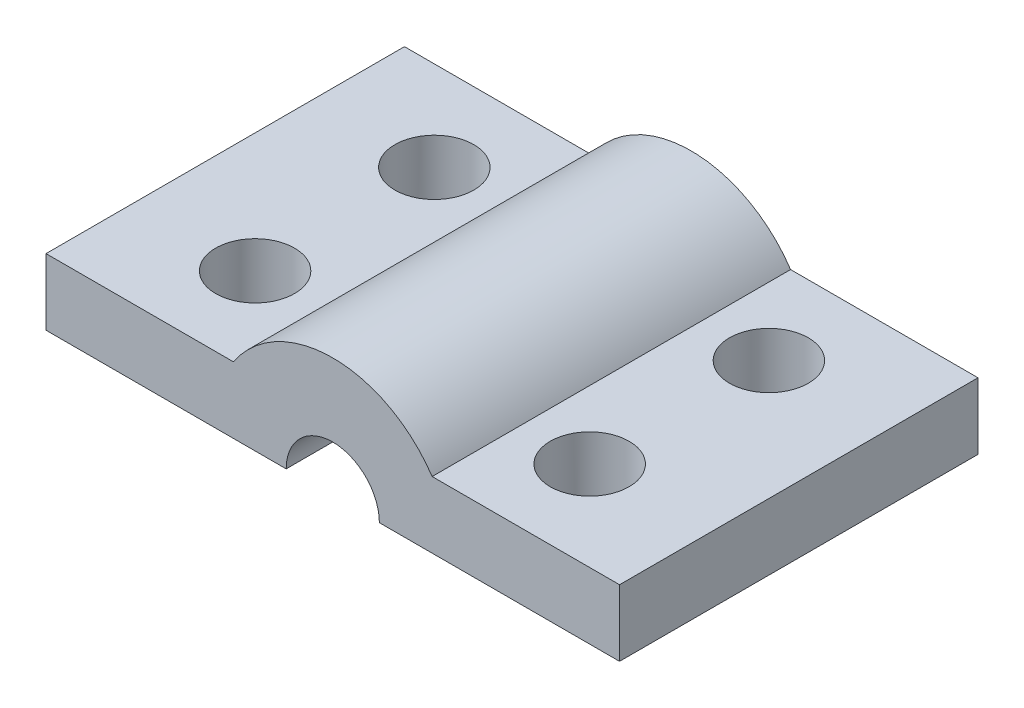
ISO-10303-21;
HEADER;
FILE_DESCRIPTION(('STEP AP214'),'2;1');
FILE_NAME('part.step','',(''),(''),'','','');
FILE_SCHEMA(('AUTOMOTIVE_DESIGN { 1 0 10303 214 1 1 1 1 }'));
ENDSEC;
DATA;
#1=APPLICATION_CONTEXT('core data for automotive mechanical design processes');
#2=APPLICATION_PROTOCOL_DEFINITION('international standard','automotive_design',2000,#1);
#3=PRODUCT_CONTEXT('',#1,'mechanical');
#4=PRODUCT('Part','Part','',(#3));
#5=PRODUCT_RELATED_PRODUCT_CATEGORY('part','',(#4));
#6=PRODUCT_DEFINITION_FORMATION('','',#4);
#7=PRODUCT_DEFINITION_CONTEXT('part definition',#1,'design');
#8=PRODUCT_DEFINITION('design','',#6,#7);
#9=PRODUCT_DEFINITION_SHAPE('','',#8);
#10=(LENGTH_UNIT() NAMED_UNIT(*) SI_UNIT(.MILLI.,.METRE.));
#11=(NAMED_UNIT(*) PLANE_ANGLE_UNIT() SI_UNIT($,.RADIAN.));
#12=(NAMED_UNIT(*) SI_UNIT($,.STERADIAN.) SOLID_ANGLE_UNIT());
#13=UNCERTAINTY_MEASURE_WITH_UNIT(LENGTH_MEASURE(1.E-05),#10,'distance_accuracy_value','');
#14=(GEOMETRIC_REPRESENTATION_CONTEXT(3) GLOBAL_UNCERTAINTY_ASSIGNED_CONTEXT((#13)) GLOBAL_UNIT_ASSIGNED_CONTEXT((#10,
#11,#12)) REPRESENTATION_CONTEXT('',''));
#15=CARTESIAN_POINT('',(0.,0.,0.));
#16=DIRECTION('',(0.,0.,1.));
#17=DIRECTION('',(1.,0.,0.));
#18=AXIS2_PLACEMENT_3D('',#15,#16,#17);
#19=CARTESIAN_POINT('',(0.,0.,7.5));
#20=DIRECTION('',(0.,-1.,0.));
#21=DIRECTION('',(1.,0.,0.));
#22=AXIS2_PLACEMENT_3D('',#19,#20,#21);
#23=PLANE('',#22);
#24=CARTESIAN_POINT('',(-7.,0.,-3.75));
#25=DIRECTION('',(0.,-1.,0.));
#26=DIRECTION('',(0.,0.,-1.));
#27=AXIS2_PLACEMENT_3D('',#24,#25,#26);
#28=CIRCLE('',#27,1.65);
#29=CARTESIAN_POINT('',(-7.,0.,-5.4));
#30=VERTEX_POINT('',#29);
#31=EDGE_CURVE('E140',#30,#30,#28,.T.);
#32=ORIENTED_EDGE('',*,*,#31,.F.);
#33=EDGE_LOOP('',(#32));
#34=FACE_BOUND('',#33,.T.);
#35=CARTESIAN_POINT('',(-7.,0.,3.75));
#36=DIRECTION('',(0.,1.,0.));
#37=DIRECTION('',(0.,0.,1.));
#38=AXIS2_PLACEMENT_3D('',#35,#36,#37);
#39=CIRCLE('',#38,1.65);
#40=CARTESIAN_POINT('',(-7.,0.,5.4));
#41=VERTEX_POINT('',#40);
#42=EDGE_CURVE('E168',#41,#41,#39,.T.);
#43=ORIENTED_EDGE('',*,*,#42,.T.);
#44=EDGE_LOOP('',(#43));
#45=FACE_BOUND('',#44,.T.);
#46=DIRECTION('',(0.,0.,-1.));
#47=VECTOR('',#46,1.);
#48=CARTESIAN_POINT('',(-12.,0.,7.5));
#49=LINE('',#48,#47);
#50=CARTESIAN_POINT('',(-12.,0.,7.5));
#51=VERTEX_POINT('',#50);
#52=CARTESIAN_POINT('',(-12.,0.,-7.5));
#53=VERTEX_POINT('',#52);
#54=EDGE_CURVE('E64',#51,#53,#49,.T.);
#55=ORIENTED_EDGE('',*,*,#54,.T.);
#56=DIRECTION('',(-1.,0.,0.));
#57=VECTOR('',#56,1.);
#58=CARTESIAN_POINT('',(0.,0.,-7.5));
#59=LINE('',#58,#57);
#60=CARTESIAN_POINT('',(-1.95,0.,-7.5));
#61=VERTEX_POINT('',#60);
#62=EDGE_CURVE('E115',#61,#53,#59,.T.);
#63=ORIENTED_EDGE('',*,*,#62,.F.);
#64=DIRECTION('',(0.,0.,-1.));
#65=VECTOR('',#64,1.);
#66=CARTESIAN_POINT('',(-1.95,0.,7.5));
#67=LINE('',#66,#65);
#68=CARTESIAN_POINT('',(-1.95,0.,7.5));
#69=VERTEX_POINT('',#68);
#70=EDGE_CURVE('E11',#69,#61,#67,.T.);
#71=ORIENTED_EDGE('',*,*,#70,.F.);
#72=DIRECTION('',(-1.,0.,0.));
#73=VECTOR('',#72,1.);
#74=CARTESIAN_POINT('',(0.,0.,7.5));
#75=LINE('',#74,#73);
#76=EDGE_CURVE('E117',#69,#51,#75,.T.);
#77=ORIENTED_EDGE('',*,*,#76,.T.);
#78=EDGE_LOOP('',(#55,#63,#71,#77));
#79=FACE_BOUND('',#78,.T.);
#80=ADVANCED_FACE('F47',(#34,#45,#79),#23,.T.);
#81=CARTESIAN_POINT('',(0.,0.,7.5));
#82=DIRECTION('',(0.,0.,-1.));
#83=DIRECTION('',(-1.,0.,0.));
#84=AXIS2_PLACEMENT_3D('',#81,#82,#83);
#85=CYLINDRICAL_SURFACE('',#84,1.95);
#86=ORIENTED_EDGE('',*,*,#70,.T.);
#87=CARTESIAN_POINT('',(0.,0.,-7.5));
#88=DIRECTION('',(0.,0.,1.));
#89=DIRECTION('',(1.,0.,0.));
#90=AXIS2_PLACEMENT_3D('',#87,#88,#89);
#91=CIRCLE('',#90,1.95);
#92=CARTESIAN_POINT('',(1.95,0.,-7.5));
#93=VERTEX_POINT('',#92);
#94=EDGE_CURVE('E134',#93,#61,#91,.T.);
#95=ORIENTED_EDGE('',*,*,#94,.F.);
#96=DIRECTION('',(0.,0.,-1.));
#97=VECTOR('',#96,1.);
#98=CARTESIAN_POINT('',(1.95,0.,7.5));
#99=LINE('',#98,#97);
#100=CARTESIAN_POINT('',(1.95,0.,7.5));
#101=VERTEX_POINT('',#100);
#102=EDGE_CURVE('E56',#101,#93,#99,.T.);
#103=ORIENTED_EDGE('',*,*,#102,.F.);
#104=CARTESIAN_POINT('',(0.,0.,7.5));
#105=DIRECTION('',(0.,0.,1.));
#106=DIRECTION('',(1.,0.,0.));
#107=AXIS2_PLACEMENT_3D('',#104,#105,#106);
#108=CIRCLE('',#107,1.95);
#109=EDGE_CURVE('E175',#101,#69,#108,.T.);
#110=ORIENTED_EDGE('',*,*,#109,.T.);
#111=EDGE_LOOP('',(#86,#95,#103,#110));
#112=FACE_BOUND('',#111,.T.);
#113=ADVANCED_FACE('F242',(#112),#85,.F.);
#114=CARTESIAN_POINT('',(0.,0.,7.5));
#115=DIRECTION('',(0.,-1.,0.));
#116=DIRECTION('',(1.,0.,0.));
#117=AXIS2_PLACEMENT_3D('',#114,#115,#116);
#118=PLANE('',#117);
#119=CARTESIAN_POINT('',(7.,0.,-3.75));
#120=DIRECTION('',(0.,1.,0.));
#121=DIRECTION('',(0.,0.,-1.));
#122=AXIS2_PLACEMENT_3D('',#119,#120,#121);
#123=CIRCLE('',#122,1.65);
#124=CARTESIAN_POINT('',(7.,0.,-5.4));
#125=VERTEX_POINT('',#124);
#126=EDGE_CURVE('E417',#125,#125,#123,.T.);
#127=ORIENTED_EDGE('',*,*,#126,.T.);
#128=EDGE_LOOP('',(#127));
#129=FACE_BOUND('',#128,.T.);
#130=CARTESIAN_POINT('',(7.,0.,3.75));
#131=DIRECTION('',(0.,-1.,0.));
#132=DIRECTION('',(0.,0.,1.));
#133=AXIS2_PLACEMENT_3D('',#130,#131,#132);
#134=CIRCLE('',#133,1.65);
#135=CARTESIAN_POINT('',(7.,0.,5.4));
#136=VERTEX_POINT('',#135);
#137=EDGE_CURVE('E163',#136,#136,#134,.T.);
#138=ORIENTED_EDGE('',*,*,#137,.F.);
#139=EDGE_LOOP('',(#138));
#140=FACE_BOUND('',#139,.T.);
#141=ORIENTED_EDGE('',*,*,#102,.T.);
#142=DIRECTION('',(-1.,0.,0.));
#143=VECTOR('',#142,1.);
#144=CARTESIAN_POINT('',(0.,0.,-7.5));
#145=LINE('',#144,#143);
#146=CARTESIAN_POINT('',(12.,0.,-7.5));
#147=VERTEX_POINT('',#146);
#148=EDGE_CURVE('E158',#147,#93,#145,.T.);
#149=ORIENTED_EDGE('',*,*,#148,.F.);
#150=DIRECTION('',(0.,0.,-1.));
#151=VECTOR('',#150,1.);
#152=CARTESIAN_POINT('',(12.,0.,7.5));
#153=LINE('',#152,#151);
#154=CARTESIAN_POINT('',(12.,0.,7.5));
#155=VERTEX_POINT('',#154);
#156=EDGE_CURVE('E208',#155,#147,#153,.T.);
#157=ORIENTED_EDGE('',*,*,#156,.F.);
#158=DIRECTION('',(-1.,0.,0.));
#159=VECTOR('',#158,1.);
#160=CARTESIAN_POINT('',(0.,0.,7.5));
#161=LINE('',#160,#159);
#162=EDGE_CURVE('E179',#155,#101,#161,.T.);
#163=ORIENTED_EDGE('',*,*,#162,.T.);
#164=EDGE_LOOP('',(#141,#149,#157,#163));
#165=FACE_BOUND('',#164,.T.);
#166=ADVANCED_FACE('F240',(#129,#140,#165),#118,.T.);
#167=CARTESIAN_POINT('',(12.,0.,7.5));
#168=DIRECTION('',(-1.,0.,0.));
#169=DIRECTION('',(0.,0.,1.));
#170=AXIS2_PLACEMENT_3D('',#167,#168,#169);
#171=PLANE('',#170);
#172=ORIENTED_EDGE('',*,*,#156,.T.);
#173=DIRECTION('',(0.,1.,0.));
#174=VECTOR('',#173,1.);
#175=CARTESIAN_POINT('',(12.,0.,-7.5));
#176=LINE('',#175,#174);
#177=CARTESIAN_POINT('',(12.,2.77751037257529,-7.5));
#178=VERTEX_POINT('',#177);
#179=EDGE_CURVE('E154',#147,#178,#176,.T.);
#180=ORIENTED_EDGE('',*,*,#179,.T.);
#181=DIRECTION('',(0.,0.,-1.));
#182=VECTOR('',#181,1.);
#183=CARTESIAN_POINT('',(12.,2.77751037257529,7.5));
#184=LINE('',#183,#182);
#185=CARTESIAN_POINT('',(12.,2.77751037257529,7.5));
#186=VERTEX_POINT('',#185);
#187=EDGE_CURVE('E205',#186,#178,#184,.T.);
#188=ORIENTED_EDGE('',*,*,#187,.F.);
#189=DIRECTION('',(0.,1.,0.));
#190=VECTOR('',#189,1.);
#191=CARTESIAN_POINT('',(12.,0.,7.5));
#192=LINE('',#191,#190);
#193=EDGE_CURVE('E183',#155,#186,#192,.T.);
#194=ORIENTED_EDGE('',*,*,#193,.F.);
#195=EDGE_LOOP('',(#172,#180,#188,#194));
#196=FACE_BOUND('',#195,.T.);
#197=ADVANCED_FACE('F226',(#196),#171,.F.);
#198=CARTESIAN_POINT('',(0.,2.77751037257529,7.5));
#199=DIRECTION('',(0.,-1.,0.));
#200=DIRECTION('',(0.,0.,-1.));
#201=AXIS2_PLACEMENT_3D('',#198,#199,#200);
#202=PLANE('',#201);
#203=CARTESIAN_POINT('',(7.,2.77751037257529,-3.75));
#204=DIRECTION('',(0.,-1.,0.));
#205=DIRECTION('',(0.,0.,-1.));
#206=AXIS2_PLACEMENT_3D('',#203,#204,#205);
#207=CIRCLE('',#206,1.65);
#208=CARTESIAN_POINT('',(7.,2.77751037257529,-5.4));
#209=VERTEX_POINT('',#208);
#210=EDGE_CURVE('E50',#209,#209,#207,.T.);
#211=ORIENTED_EDGE('',*,*,#210,.T.);
#212=EDGE_LOOP('',(#211));
#213=FACE_BOUND('',#212,.T.);
#214=CARTESIAN_POINT('',(7.,2.77751037257529,3.75));
#215=DIRECTION('',(0.,-1.,0.));
#216=DIRECTION('',(0.,0.,-1.));
#217=AXIS2_PLACEMENT_3D('',#214,#215,#216);
#218=CIRCLE('',#217,1.65);
#219=CARTESIAN_POINT('',(7.,2.77751037257529,2.1));
#220=VERTEX_POINT('',#219);
#221=EDGE_CURVE('E167',#220,#220,#218,.F.);
#222=ORIENTED_EDGE('',*,*,#221,.F.);
#223=EDGE_LOOP('',(#222));
#224=FACE_BOUND('',#223,.T.);
#225=ORIENTED_EDGE('',*,*,#187,.T.);
#226=DIRECTION('',(-1.,0.,0.));
#227=VECTOR('',#226,1.);
#228=CARTESIAN_POINT('',(0.,2.77751037257529,-7.5));
#229=LINE('',#228,#227);
#230=CARTESIAN_POINT('',(4.15757575159331,2.77751037257529,-7.5));
#231=VERTEX_POINT('',#230);
#232=EDGE_CURVE('E150',#178,#231,#229,.T.);
#233=ORIENTED_EDGE('',*,*,#232,.T.);
#234=DIRECTION('',(0.,0.,-1.));
#235=VECTOR('',#234,1.);
#236=CARTESIAN_POINT('',(4.15757575159331,2.77751037257529,7.5));
#237=LINE('',#236,#235);
#238=CARTESIAN_POINT('',(4.15757575159331,2.77751037257529,7.5));
#239=VERTEX_POINT('',#238);
#240=EDGE_CURVE('E202',#239,#231,#237,.T.);
#241=ORIENTED_EDGE('',*,*,#240,.F.);
#242=DIRECTION('',(-1.,0.,0.));
#243=VECTOR('',#242,1.);
#244=CARTESIAN_POINT('',(0.,2.77751037257529,7.5));
#245=LINE('',#244,#243);
#246=EDGE_CURVE('E186',#186,#239,#245,.T.);
#247=ORIENTED_EDGE('',*,*,#246,.F.);
#248=EDGE_LOOP('',(#225,#233,#241,#247));
#249=FACE_BOUND('',#248,.T.);
#250=ADVANCED_FACE('F222',(#213,#224,#249),#202,.F.);
#251=CARTESIAN_POINT('',(0.,0.,7.5));
#252=DIRECTION('',(0.,0.,-1.));
#253=DIRECTION('',(-1.,0.,0.));
#254=AXIS2_PLACEMENT_3D('',#251,#252,#253);
#255=CYLINDRICAL_SURFACE('',#254,5.);
#256=ORIENTED_EDGE('',*,*,#240,.T.);
#257=CARTESIAN_POINT('',(0.,0.,-7.5));
#258=DIRECTION('',(0.,0.,1.));
#259=DIRECTION('',(1.,0.,0.));
#260=AXIS2_PLACEMENT_3D('',#257,#258,#259);
#261=CIRCLE('',#260,5.);
#262=CARTESIAN_POINT('',(-4.15757575159331,2.77751037257529,-7.5));
#263=VERTEX_POINT('',#262);
#264=EDGE_CURVE('E146',#231,#263,#261,.T.);
#265=ORIENTED_EDGE('',*,*,#264,.T.);
#266=DIRECTION('',(0.,0.,-1.));
#267=VECTOR('',#266,1.);
#268=CARTESIAN_POINT('',(-4.15757575159331,2.77751037257529,7.5));
#269=LINE('',#268,#267);
#270=CARTESIAN_POINT('',(-4.15757575159331,2.77751037257529,7.5));
#271=VERTEX_POINT('',#270);
#272=EDGE_CURVE('E199',#271,#263,#269,.T.);
#273=ORIENTED_EDGE('',*,*,#272,.F.);
#274=CARTESIAN_POINT('',(0.,0.,7.5));
#275=DIRECTION('',(0.,0.,1.));
#276=DIRECTION('',(1.,0.,0.));
#277=AXIS2_PLACEMENT_3D('',#274,#275,#276);
#278=CIRCLE('',#277,5.);
#279=EDGE_CURVE('E189',#239,#271,#278,.T.);
#280=ORIENTED_EDGE('',*,*,#279,.F.);
#281=EDGE_LOOP('',(#256,#265,#273,#280));
#282=FACE_BOUND('',#281,.T.);
#283=ADVANCED_FACE('F225',(#282),#255,.T.);
#284=CARTESIAN_POINT('',(0.,2.77751037257529,7.5));
#285=DIRECTION('',(0.,1.,0.));
#286=DIRECTION('',(0.,0.,1.));
#287=AXIS2_PLACEMENT_3D('',#284,#285,#286);
#288=PLANE('',#287);
#289=CARTESIAN_POINT('',(-7.,2.77751037257529,-3.75));
#290=DIRECTION('',(0.,1.,0.));
#291=DIRECTION('',(0.,0.,1.));
#292=AXIS2_PLACEMENT_3D('',#289,#290,#291);
#293=CIRCLE('',#292,1.65);
#294=CARTESIAN_POINT('',(-7.,2.77751037257529,-2.1));
#295=VERTEX_POINT('',#294);
#296=EDGE_CURVE('E136',#295,#295,#293,.F.);
#297=ORIENTED_EDGE('',*,*,#296,.T.);
#298=EDGE_LOOP('',(#297));
#299=FACE_BOUND('',#298,.T.);
#300=CARTESIAN_POINT('',(-7.,2.77751037257529,3.75));
#301=DIRECTION('',(0.,1.,0.));
#302=DIRECTION('',(0.,0.,1.));
#303=AXIS2_PLACEMENT_3D('',#300,#301,#302);
#304=CIRCLE('',#303,1.65);
#305=CARTESIAN_POINT('',(-7.,2.77751037257529,5.4));
#306=VERTEX_POINT('',#305);
#307=EDGE_CURVE('E172',#306,#306,#304,.T.);
#308=ORIENTED_EDGE('',*,*,#307,.F.);
#309=EDGE_LOOP('',(#308));
#310=FACE_BOUND('',#309,.T.);
#311=ORIENTED_EDGE('',*,*,#272,.T.);
#312=DIRECTION('',(1.,0.,0.));
#313=VECTOR('',#312,1.);
#314=CARTESIAN_POINT('',(0.,2.77751037257529,-7.5));
#315=LINE('',#314,#313);
#316=CARTESIAN_POINT('',(-12.,2.77751037257529,-7.5));
#317=VERTEX_POINT('',#316);
#318=EDGE_CURVE('E128',#317,#263,#315,.T.);
#319=ORIENTED_EDGE('',*,*,#318,.F.);
#320=DIRECTION('',(0.,0.,-1.));
#321=VECTOR('',#320,1.);
#322=CARTESIAN_POINT('',(-12.,2.77751037257529,7.5));
#323=LINE('',#322,#321);
#324=CARTESIAN_POINT('',(-12.,2.77751037257529,7.5));
#325=VERTEX_POINT('',#324);
#326=EDGE_CURVE('E72',#325,#317,#323,.T.);
#327=ORIENTED_EDGE('',*,*,#326,.F.);
#328=DIRECTION('',(1.,0.,0.));
#329=VECTOR('',#328,1.);
#330=CARTESIAN_POINT('',(0.,2.77751037257529,7.5));
#331=LINE('',#330,#329);
#332=EDGE_CURVE('E192',#325,#271,#331,.T.);
#333=ORIENTED_EDGE('',*,*,#332,.T.);
#334=EDGE_LOOP('',(#311,#319,#327,#333));
#335=FACE_BOUND('',#334,.T.);
#336=ADVANCED_FACE('F248',(#299,#310,#335),#288,.T.);
#337=CARTESIAN_POINT('',(-12.,0.,7.5));
#338=DIRECTION('',(-1.,0.,0.));
#339=DIRECTION('',(0.,0.,1.));
#340=AXIS2_PLACEMENT_3D('',#337,#338,#339);
#341=PLANE('',#340);
#342=ORIENTED_EDGE('',*,*,#326,.T.);
#343=DIRECTION('',(0.,1.,0.));
#344=VECTOR('',#343,1.);
#345=CARTESIAN_POINT('',(-12.,0.,-7.5));
#346=LINE('',#345,#344);
#347=EDGE_CURVE('E123',#53,#317,#346,.T.);
#348=ORIENTED_EDGE('',*,*,#347,.F.);
#349=ORIENTED_EDGE('',*,*,#54,.F.);
#350=DIRECTION('',(0.,1.,0.));
#351=VECTOR('',#350,1.);
#352=CARTESIAN_POINT('',(-12.,0.,7.5));
#353=LINE('',#352,#351);
#354=EDGE_CURVE('E120',#51,#325,#353,.T.);
#355=ORIENTED_EDGE('',*,*,#354,.T.);
#356=EDGE_LOOP('',(#342,#348,#349,#355));
#357=FACE_BOUND('',#356,.T.);
#358=ADVANCED_FACE('F124',(#357),#341,.T.);
#359=CARTESIAN_POINT('',(0.,0.,7.5));
#360=DIRECTION('',(0.,0.,1.));
#361=DIRECTION('',(1.,0.,0.));
#362=AXIS2_PLACEMENT_3D('',#359,#360,#361);
#363=PLANE('',#362);
#364=ORIENTED_EDGE('',*,*,#76,.F.);
#365=ORIENTED_EDGE('',*,*,#109,.F.);
#366=ORIENTED_EDGE('',*,*,#162,.F.);
#367=ORIENTED_EDGE('',*,*,#193,.T.);
#368=ORIENTED_EDGE('',*,*,#246,.T.);
#369=ORIENTED_EDGE('',*,*,#279,.T.);
#370=ORIENTED_EDGE('',*,*,#332,.F.);
#371=ORIENTED_EDGE('',*,*,#354,.F.);
#372=EDGE_LOOP('',(#364,#365,#366,#367,#368,#369,#370,#371));
#373=FACE_BOUND('',#372,.T.);
#374=ADVANCED_FACE('F245',(#373),#363,.T.);
#375=CARTESIAN_POINT('',(-7.,0.,3.75));
#376=DIRECTION('',(0.,1.,0.));
#377=DIRECTION('',(0.,0.,1.));
#378=AXIS2_PLACEMENT_3D('',#375,#376,#377);
#379=CYLINDRICAL_SURFACE('',#378,1.65);
#380=ORIENTED_EDGE('',*,*,#307,.T.);
#381=EDGE_LOOP('',(#380));
#382=FACE_BOUND('',#381,.T.);
#383=ORIENTED_EDGE('',*,*,#42,.F.);
#384=EDGE_LOOP('',(#383));
#385=FACE_BOUND('',#384,.T.);
#386=ADVANCED_FACE('F268',(#382,#385),#379,.F.);
#387=CARTESIAN_POINT('',(7.,0.,3.75));
#388=DIRECTION('',(0.,1.,0.));
#389=DIRECTION('',(0.,0.,1.));
#390=AXIS2_PLACEMENT_3D('',#387,#388,#389);
#391=CYLINDRICAL_SURFACE('',#390,1.65);
#392=ORIENTED_EDGE('',*,*,#137,.T.);
#393=EDGE_LOOP('',(#392));
#394=FACE_BOUND('',#393,.T.);
#395=ORIENTED_EDGE('',*,*,#221,.T.);
#396=EDGE_LOOP('',(#395));
#397=FACE_BOUND('',#396,.T.);
#398=ADVANCED_FACE('F220',(#394,#397),#391,.F.);
#399=CARTESIAN_POINT('',(0.,0.,-7.5));
#400=DIRECTION('',(0.,0.,-1.));
#401=DIRECTION('',(1.,0.,0.));
#402=AXIS2_PLACEMENT_3D('',#399,#400,#401);
#403=PLANE('',#402);
#404=ORIENTED_EDGE('',*,*,#62,.T.);
#405=ORIENTED_EDGE('',*,*,#347,.T.);
#406=ORIENTED_EDGE('',*,*,#318,.T.);
#407=ORIENTED_EDGE('',*,*,#264,.F.);
#408=ORIENTED_EDGE('',*,*,#232,.F.);
#409=ORIENTED_EDGE('',*,*,#179,.F.);
#410=ORIENTED_EDGE('',*,*,#148,.T.);
#411=ORIENTED_EDGE('',*,*,#94,.T.);
#412=EDGE_LOOP('',(#404,#405,#406,#407,#408,#409,#410,#411));
#413=FACE_BOUND('',#412,.T.);
#414=ADVANCED_FACE('F131',(#413),#403,.T.);
#415=CARTESIAN_POINT('',(-7.,0.,-3.75));
#416=DIRECTION('',(0.,1.,0.));
#417=DIRECTION('',(0.,0.,1.));
#418=AXIS2_PLACEMENT_3D('',#415,#416,#417);
#419=CYLINDRICAL_SURFACE('',#418,1.65);
#420=ORIENTED_EDGE('',*,*,#296,.F.);
#421=EDGE_LOOP('',(#420));
#422=FACE_BOUND('',#421,.T.);
#423=ORIENTED_EDGE('',*,*,#31,.T.);
#424=EDGE_LOOP('',(#423));
#425=FACE_BOUND('',#424,.T.);
#426=ADVANCED_FACE('F293',(#422,#425),#419,.F.);
#427=CARTESIAN_POINT('',(7.,0.,-3.75));
#428=DIRECTION('',(0.,1.,0.));
#429=DIRECTION('',(0.,0.,1.));
#430=AXIS2_PLACEMENT_3D('',#427,#428,#429);
#431=CYLINDRICAL_SURFACE('',#430,1.65);
#432=ORIENTED_EDGE('',*,*,#126,.F.);
#433=EDGE_LOOP('',(#432));
#434=FACE_BOUND('',#433,.T.);
#435=ORIENTED_EDGE('',*,*,#210,.F.);
#436=EDGE_LOOP('',(#435));
#437=FACE_BOUND('',#436,.T.);
#438=ADVANCED_FACE('F300',(#434,#437),#431,.F.);
#439=CLOSED_SHELL('',(#80,#113,#166,#197,#250,#283,#336,#358,#374,#386,#398,#414,#426,#438));
#440=MANIFOLD_SOLID_BREP('B2',#439);
#441=ADVANCED_BREP_SHAPE_REPRESENTATION('',(#18,#440),#14);
#442=SHAPE_DEFINITION_REPRESENTATION(#9,#441);
ENDSEC;
END-ISO-10303-21;
